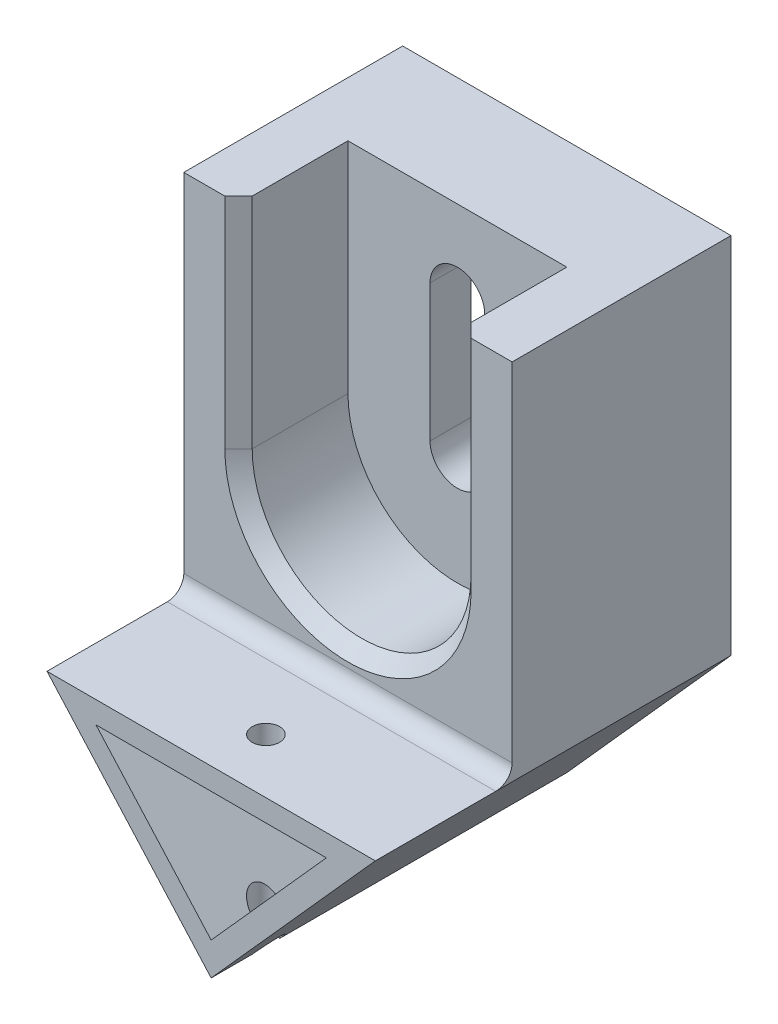
ISO-10303-21;
HEADER;
FILE_DESCRIPTION(('STEP AP214'),'2;1');
FILE_NAME('part.step','',(''),(''),'','','');
FILE_SCHEMA(('AUTOMOTIVE_DESIGN { 1 0 10303 214 1 1 1 1 }'));
ENDSEC;
DATA;
#1=APPLICATION_CONTEXT('core data for automotive mechanical design processes');
#2=APPLICATION_PROTOCOL_DEFINITION('international standard','automotive_design',2000,#1);
#3=PRODUCT_CONTEXT('',#1,'mechanical');
#4=PRODUCT('Part','Part','',(#3));
#5=PRODUCT_RELATED_PRODUCT_CATEGORY('part','',(#4));
#6=PRODUCT_DEFINITION_FORMATION('','',#4);
#7=PRODUCT_DEFINITION_CONTEXT('part definition',#1,'design');
#8=PRODUCT_DEFINITION('design','',#6,#7);
#9=PRODUCT_DEFINITION_SHAPE('','',#8);
#10=(LENGTH_UNIT() NAMED_UNIT(*) SI_UNIT(.MILLI.,.METRE.));
#11=(NAMED_UNIT(*) PLANE_ANGLE_UNIT() SI_UNIT($,.RADIAN.));
#12=(NAMED_UNIT(*) SI_UNIT($,.STERADIAN.) SOLID_ANGLE_UNIT());
#13=UNCERTAINTY_MEASURE_WITH_UNIT(LENGTH_MEASURE(1.E-05),#10,'distance_accuracy_value','');
#14=(GEOMETRIC_REPRESENTATION_CONTEXT(3) GLOBAL_UNCERTAINTY_ASSIGNED_CONTEXT((#13)) GLOBAL_UNIT_ASSIGNED_CONTEXT((#10,
#11,#12)) REPRESENTATION_CONTEXT('',''));
#15=CARTESIAN_POINT('',(0.,0.,0.));
#16=DIRECTION('',(0.,0.,1.));
#17=DIRECTION('',(1.,0.,0.));
#18=AXIS2_PLACEMENT_3D('',#15,#16,#17);
#19=CARTESIAN_POINT('',(0.,0.,130.));
#20=DIRECTION('',(0.,0.,-1.));
#21=DIRECTION('',(-1.,0.,0.));
#22=AXIS2_PLACEMENT_3D('',#19,#20,#21);
#23=PLANE('',#22);
#24=DIRECTION('',(0.666666666666667,0.74535599249993,0.));
#25=VECTOR('',#24,1.);
#26=CARTESIAN_POINT('',(60.,67.0820393249937,130.));
#27=LINE('',#26,#25);
#28=CARTESIAN_POINT('',(0.,0.,130.));
#29=VERTEX_POINT('',#28);
#30=CARTESIAN_POINT('',(60.,67.0820393249937,130.));
#31=VERTEX_POINT('',#30);
#32=EDGE_CURVE('E252',#29,#31,#27,.T.);
#33=ORIENTED_EDGE('',*,*,#32,.T.);
#34=DIRECTION('',(-1.,0.,0.));
#35=VECTOR('',#34,1.);
#36=CARTESIAN_POINT('',(-60.,67.0820393249937,130.));
#37=LINE('',#36,#35);
#38=CARTESIAN_POINT('',(-60.,67.0820393249937,130.));
#39=VERTEX_POINT('',#38);
#40=EDGE_CURVE('E255',#31,#39,#37,.T.);
#41=ORIENTED_EDGE('',*,*,#40,.T.);
#42=DIRECTION('',(0.666666666666667,-0.74535599249993,0.));
#43=VECTOR('',#42,1.);
#44=CARTESIAN_POINT('',(0.,0.,130.));
#45=LINE('',#44,#43);
#46=EDGE_CURVE('E257',#39,#29,#45,.T.);
#47=ORIENTED_EDGE('',*,*,#46,.T.);
#48=EDGE_LOOP('',(#33,#41,#47));
#49=FACE_BOUND('',#48,.T.);
#50=DIRECTION('',(0.666666666666667,0.74535599249993,0.));
#51=VECTOR('',#50,1.);
#52=CARTESIAN_POINT('',(42.1114561800017,59.0820393249937,130.));
#53=LINE('',#52,#51);
#54=CARTESIAN_POINT('',(0.,12.,130.));
#55=VERTEX_POINT('',#54);
#56=CARTESIAN_POINT('',(42.1114561800017,59.0820393249937,130.));
#57=VERTEX_POINT('',#56);
#58=EDGE_CURVE('E242',#55,#57,#53,.T.);
#59=ORIENTED_EDGE('',*,*,#58,.F.);
#60=DIRECTION('',(0.666666666666667,-0.74535599249993,0.));
#61=VECTOR('',#60,1.);
#62=CARTESIAN_POINT('',(0.,12.,130.));
#63=LINE('',#62,#61);
#64=CARTESIAN_POINT('',(-42.1114561800017,59.0820393249937,130.));
#65=VERTEX_POINT('',#64);
#66=EDGE_CURVE('E351',#65,#55,#63,.T.);
#67=ORIENTED_EDGE('',*,*,#66,.F.);
#68=DIRECTION('',(-1.,0.,0.));
#69=VECTOR('',#68,1.);
#70=CARTESIAN_POINT('',(-42.1114561800017,59.0820393249937,130.));
#71=LINE('',#70,#69);
#72=EDGE_CURVE('E348',#57,#65,#71,.T.);
#73=ORIENTED_EDGE('',*,*,#72,.F.);
#74=EDGE_LOOP('',(#59,#67,#73));
#75=FACE_BOUND('',#74,.T.);
#76=ADVANCED_FACE('F42',(#49,#75),#23,.F.);
#77=CARTESIAN_POINT('',(0.,0.,0.));
#78=DIRECTION('',(0.,0.,-1.));
#79=DIRECTION('',(-1.,0.,0.));
#80=AXIS2_PLACEMENT_3D('',#77,#78,#79);
#81=PLANE('',#80);
#82=DIRECTION('',(0.,-1.,0.));
#83=VECTOR('',#82,1.);
#84=CARTESIAN_POINT('',(42.1114561800017,59.0820393249937,0.));
#85=LINE('',#84,#83);
#86=CARTESIAN_POINT('',(42.1114561800017,190.,0.));
#87=VERTEX_POINT('',#86);
#88=CARTESIAN_POINT('',(42.1114561800017,59.0820393249937,0.));
#89=VERTEX_POINT('',#88);
#90=EDGE_CURVE('E215',#87,#89,#85,.T.);
#91=ORIENTED_EDGE('',*,*,#90,.F.);
#92=DIRECTION('',(1.,0.,0.));
#93=VECTOR('',#92,1.);
#94=CARTESIAN_POINT('',(42.1114561800017,190.,0.));
#95=LINE('',#94,#93);
#96=CARTESIAN_POINT('',(-42.1114561800017,190.,0.));
#97=VERTEX_POINT('',#96);
#98=EDGE_CURVE('E225',#97,#87,#95,.T.);
#99=ORIENTED_EDGE('',*,*,#98,.F.);
#100=DIRECTION('',(0.,1.,0.));
#101=VECTOR('',#100,1.);
#102=CARTESIAN_POINT('',(-42.1114561800017,59.0820393249937,0.));
#103=LINE('',#102,#101);
#104=CARTESIAN_POINT('',(-42.1114561800017,59.0820393249937,0.));
#105=VERTEX_POINT('',#104);
#106=EDGE_CURVE('E371',#105,#97,#103,.T.);
#107=ORIENTED_EDGE('',*,*,#106,.F.);
#108=DIRECTION('',(0.666666666666667,-0.74535599249993,0.));
#109=VECTOR('',#108,1.);
#110=CARTESIAN_POINT('',(0.,12.,0.));
#111=LINE('',#110,#109);
#112=CARTESIAN_POINT('',(0.,12.,0.));
#113=VERTEX_POINT('',#112);
#114=EDGE_CURVE('E349',#105,#113,#111,.T.);
#115=ORIENTED_EDGE('',*,*,#114,.T.);
#116=DIRECTION('',(0.666666666666667,0.74535599249993,0.));
#117=VECTOR('',#116,1.);
#118=CARTESIAN_POINT('',(42.1114561800017,59.0820393249937,0.));
#119=LINE('',#118,#117);
#120=EDGE_CURVE('E354',#113,#89,#119,.T.);
#121=ORIENTED_EDGE('',*,*,#120,.T.);
#122=EDGE_LOOP('',(#91,#99,#107,#115,#121));
#123=FACE_BOUND('',#122,.T.);
#124=DIRECTION('',(0.666666666666667,0.74535599249993,0.));
#125=VECTOR('',#124,1.);
#126=CARTESIAN_POINT('',(60.,67.0820393249937,0.));
#127=LINE('',#126,#125);
#128=CARTESIAN_POINT('',(0.,0.,0.));
#129=VERTEX_POINT('',#128);
#130=CARTESIAN_POINT('',(60.,67.0820393249937,0.));
#131=VERTEX_POINT('',#130);
#132=EDGE_CURVE('E243',#129,#131,#127,.T.);
#133=ORIENTED_EDGE('',*,*,#132,.F.);
#134=DIRECTION('',(0.666666666666667,-0.74535599249993,0.));
#135=VECTOR('',#134,1.);
#136=CARTESIAN_POINT('',(0.,0.,0.));
#137=LINE('',#136,#135);
#138=CARTESIAN_POINT('',(-60.,67.0820393249937,0.));
#139=VERTEX_POINT('',#138);
#140=EDGE_CURVE('E246',#139,#129,#137,.T.);
#141=ORIENTED_EDGE('',*,*,#140,.F.);
#142=DIRECTION('',(0.,1.,0.));
#143=VECTOR('',#142,1.);
#144=CARTESIAN_POINT('',(-60.,67.0820393249937,0.));
#145=LINE('',#144,#143);
#146=CARTESIAN_POINT('',(-60.,200.,0.));
#147=VERTEX_POINT('',#146);
#148=EDGE_CURVE('E452',#139,#147,#145,.T.);
#149=ORIENTED_EDGE('',*,*,#148,.T.);
#150=DIRECTION('',(1.,0.,0.));
#151=VECTOR('',#150,1.);
#152=CARTESIAN_POINT('',(60.,200.,0.));
#153=LINE('',#152,#151);
#154=CARTESIAN_POINT('',(60.,200.,0.));
#155=VERTEX_POINT('',#154);
#156=EDGE_CURVE('E449',#147,#155,#153,.T.);
#157=ORIENTED_EDGE('',*,*,#156,.T.);
#158=DIRECTION('',(0.,-1.,0.));
#159=VECTOR('',#158,1.);
#160=CARTESIAN_POINT('',(60.,67.0820393249937,0.));
#161=LINE('',#160,#159);
#162=EDGE_CURVE('E446',#155,#131,#161,.T.);
#163=ORIENTED_EDGE('',*,*,#162,.T.);
#164=EDGE_LOOP('',(#133,#141,#149,#157,#163));
#165=FACE_BOUND('',#164,.T.);
#166=ADVANCED_FACE('F367',(#123,#165),#81,.T.);
#167=CARTESIAN_POINT('',(60.,67.0820393249937,130.));
#168=DIRECTION('',(-0.74535599249993,0.666666666666667,0.));
#169=DIRECTION('',(-0.666666666666667,-0.74535599249993,0.));
#170=AXIS2_PLACEMENT_3D('',#167,#168,#169);
#171=PLANE('',#170);
#172=DIRECTION('',(0.,0.,-1.));
#173=VECTOR('',#172,1.);
#174=CARTESIAN_POINT('',(0.,0.,130.));
#175=LINE('',#174,#173);
#176=CARTESIAN_POINT('',(0.,0.,115.));
#177=VERTEX_POINT('',#176);
#178=EDGE_CURVE('E262',#29,#177,#175,.T.);
#179=ORIENTED_EDGE('',*,*,#178,.T.);
#180=CARTESIAN_POINT('',(0.,0.,110.));
#181=DIRECTION('',(-0.74535599249993,0.666666666666667,0.));
#182=DIRECTION('',(0.666666666666667,0.74535599249993,0.));
#183=AXIS2_PLACEMENT_3D('',#180,#181,#182);
#184=ELLIPSE('',#183,7.50000000000001,5.);
#185=CARTESIAN_POINT('',(0.,0.,105.));
#186=VERTEX_POINT('',#185);
#187=EDGE_CURVE('E443',#177,#186,#184,.T.);
#188=ORIENTED_EDGE('',*,*,#187,.T.);
#189=EDGE_CURVE('E258',#186,#129,#175,.T.);
#190=ORIENTED_EDGE('',*,*,#189,.T.);
#191=ORIENTED_EDGE('',*,*,#132,.T.);
#192=DIRECTION('',(0.,0.,-1.));
#193=VECTOR('',#192,1.);
#194=CARTESIAN_POINT('',(60.,67.0820393249937,80.));
#195=LINE('',#194,#193);
#196=CARTESIAN_POINT('',(60.,67.0820393249937,86.));
#197=VERTEX_POINT('',#196);
#198=EDGE_CURVE('E311',#197,#131,#195,.T.);
#199=ORIENTED_EDGE('',*,*,#198,.F.);
#200=DIRECTION('',(0.,0.,-1.));
#201=VECTOR('',#200,1.);
#202=CARTESIAN_POINT('',(60.,67.0820393249937,130.));
#203=LINE('',#202,#201);
#204=EDGE_CURVE('E268',#31,#197,#203,.T.);
#205=ORIENTED_EDGE('',*,*,#204,.F.);
#206=ORIENTED_EDGE('',*,*,#32,.F.);
#207=EDGE_LOOP('',(#179,#188,#190,#191,#199,#205,#206));
#208=FACE_BOUND('',#207,.T.);
#209=ADVANCED_FACE('F336',(#208),#171,.F.);
#210=CARTESIAN_POINT('',(-60.,67.0820393249937,130.));
#211=DIRECTION('',(0.,-1.,0.));
#212=DIRECTION('',(0.,0.,-1.));
#213=AXIS2_PLACEMENT_3D('',#210,#211,#212);
#214=PLANE('',#213);
#215=CARTESIAN_POINT('',(0.,67.0820393249937,110.));
#216=DIRECTION('',(0.,1.,0.));
#217=DIRECTION('',(0.,0.,1.));
#218=AXIS2_PLACEMENT_3D('',#215,#216,#217);
#219=CIRCLE('',#218,5.);
#220=CARTESIAN_POINT('',(0.,67.0820393249937,115.));
#221=VERTEX_POINT('',#220);
#222=EDGE_CURVE('E425',#221,#221,#219,.T.);
#223=ORIENTED_EDGE('',*,*,#222,.F.);
#224=EDGE_LOOP('',(#223));
#225=FACE_BOUND('',#224,.T.);
#226=ORIENTED_EDGE('',*,*,#204,.T.);
#227=DIRECTION('',(-1.,0.,0.));
#228=VECTOR('',#227,1.);
#229=CARTESIAN_POINT('',(-60.,67.0820393249937,86.));
#230=LINE('',#229,#228);
#231=CARTESIAN_POINT('',(-60.,67.0820393249937,86.));
#232=VERTEX_POINT('',#231);
#233=EDGE_CURVE('E290',#197,#232,#230,.T.);
#234=ORIENTED_EDGE('',*,*,#233,.T.);
#235=DIRECTION('',(0.,0.,-1.));
#236=VECTOR('',#235,1.);
#237=CARTESIAN_POINT('',(-60.,67.0820393249937,130.));
#238=LINE('',#237,#236);
#239=EDGE_CURVE('E265',#39,#232,#238,.T.);
#240=ORIENTED_EDGE('',*,*,#239,.F.);
#241=ORIENTED_EDGE('',*,*,#40,.F.);
#242=EDGE_LOOP('',(#226,#234,#240,#241));
#243=FACE_BOUND('',#242,.T.);
#244=ADVANCED_FACE('F321',(#225,#243),#214,.F.);
#245=CARTESIAN_POINT('',(0.,0.,130.));
#246=DIRECTION('',(0.74535599249993,0.666666666666666,0.));
#247=DIRECTION('',(-0.666666666666667,0.74535599249993,0.));
#248=AXIS2_PLACEMENT_3D('',#245,#246,#247);
#249=PLANE('',#248);
#250=ORIENTED_EDGE('',*,*,#189,.F.);
#251=CARTESIAN_POINT('',(0.,0.,110.));
#252=DIRECTION('',(0.74535599249993,0.666666666666666,0.));
#253=DIRECTION('',(-0.666666666666667,0.74535599249993,0.));
#254=AXIS2_PLACEMENT_3D('',#251,#252,#253);
#255=ELLIPSE('',#254,7.50000000000001,5.);
#256=EDGE_CURVE('E441',#186,#177,#255,.T.);
#257=ORIENTED_EDGE('',*,*,#256,.T.);
#258=ORIENTED_EDGE('',*,*,#178,.F.);
#259=ORIENTED_EDGE('',*,*,#46,.F.);
#260=ORIENTED_EDGE('',*,*,#239,.T.);
#261=DIRECTION('',(0.,0.,-1.));
#262=VECTOR('',#261,1.);
#263=CARTESIAN_POINT('',(-60.,67.0820393249937,80.));
#264=LINE('',#263,#262);
#265=EDGE_CURVE('E328',#232,#139,#264,.T.);
#266=ORIENTED_EDGE('',*,*,#265,.T.);
#267=ORIENTED_EDGE('',*,*,#140,.T.);
#268=EDGE_LOOP('',(#250,#257,#258,#259,#260,#266,#267));
#269=FACE_BOUND('',#268,.T.);
#270=ADVANCED_FACE('F327',(#269),#249,.F.);
#271=CARTESIAN_POINT('',(42.1114561800017,59.0820393249937,130.));
#272=DIRECTION('',(-0.74535599249993,0.666666666666667,0.));
#273=DIRECTION('',(-0.666666666666667,-0.74535599249993,0.));
#274=AXIS2_PLACEMENT_3D('',#271,#272,#273);
#275=PLANE('',#274);
#276=CARTESIAN_POINT('',(0.,12.,110.));
#277=DIRECTION('',(-0.74535599249993,0.666666666666667,0.));
#278=DIRECTION('',(0.666666666666667,0.74535599249993,0.));
#279=AXIS2_PLACEMENT_3D('',#276,#277,#278);
#280=ELLIPSE('',#279,7.50000000000001,5.);
#281=CARTESIAN_POINT('',(0.,12.,115.));
#282=VERTEX_POINT('',#281);
#283=CARTESIAN_POINT('',(0.,12.,105.));
#284=VERTEX_POINT('',#283);
#285=EDGE_CURVE('E436',#282,#284,#280,.T.);
#286=ORIENTED_EDGE('',*,*,#285,.F.);
#287=DIRECTION('',(0.,0.,-1.));
#288=VECTOR('',#287,1.);
#289=CARTESIAN_POINT('',(0.,12.,130.));
#290=LINE('',#289,#288);
#291=EDGE_CURVE('E248',#55,#282,#290,.T.);
#292=ORIENTED_EDGE('',*,*,#291,.F.);
#293=ORIENTED_EDGE('',*,*,#58,.T.);
#294=DIRECTION('',(0.,0.,-1.));
#295=VECTOR('',#294,1.);
#296=CARTESIAN_POINT('',(42.1114561800017,59.0820393249937,130.));
#297=LINE('',#296,#295);
#298=CARTESIAN_POINT('',(42.1114561800017,59.0820393249937,25.));
#299=VERTEX_POINT('',#298);
#300=EDGE_CURVE('E233',#57,#299,#297,.T.);
#301=ORIENTED_EDGE('',*,*,#300,.T.);
#302=DIRECTION('',(0.,0.,-1.));
#303=VECTOR('',#302,1.);
#304=CARTESIAN_POINT('',(42.1114561800017,59.0820393249937,25.));
#305=LINE('',#304,#303);
#306=EDGE_CURVE('E210',#299,#89,#305,.T.);
#307=ORIENTED_EDGE('',*,*,#306,.T.);
#308=ORIENTED_EDGE('',*,*,#120,.F.);
#309=EDGE_CURVE('E353',#284,#113,#290,.T.);
#310=ORIENTED_EDGE('',*,*,#309,.F.);
#311=EDGE_LOOP('',(#286,#292,#293,#301,#307,#308,#310));
#312=FACE_BOUND('',#311,.T.);
#313=ADVANCED_FACE('F239',(#312),#275,.T.);
#314=CARTESIAN_POINT('',(-42.1114561800017,59.0820393249937,130.));
#315=DIRECTION('',(0.,-1.,0.));
#316=DIRECTION('',(0.,0.,-1.));
#317=AXIS2_PLACEMENT_3D('',#314,#315,#316);
#318=PLANE('',#317);
#319=DIRECTION('',(-1.,0.,0.));
#320=VECTOR('',#319,1.);
#321=CARTESIAN_POINT('',(42.1114561800017,59.0820393249937,25.));
#322=LINE('',#321,#320);
#323=CARTESIAN_POINT('',(-42.1114561800017,59.0820393249937,25.));
#324=VERTEX_POINT('',#323);
#325=EDGE_CURVE('E57',#299,#324,#322,.T.);
#326=ORIENTED_EDGE('',*,*,#325,.F.);
#327=ORIENTED_EDGE('',*,*,#300,.F.);
#328=ORIENTED_EDGE('',*,*,#72,.T.);
#329=DIRECTION('',(0.,0.,-1.));
#330=VECTOR('',#329,1.);
#331=CARTESIAN_POINT('',(-42.1114561800017,59.0820393249937,130.));
#332=LINE('',#331,#330);
#333=EDGE_CURVE('E235',#65,#324,#332,.T.);
#334=ORIENTED_EDGE('',*,*,#333,.T.);
#335=EDGE_LOOP('',(#326,#327,#328,#334));
#336=FACE_BOUND('',#335,.T.);
#337=CARTESIAN_POINT('',(0.,59.0820393249937,110.));
#338=DIRECTION('',(0.,-1.,0.));
#339=DIRECTION('',(0.,0.,-1.));
#340=AXIS2_PLACEMENT_3D('',#337,#338,#339);
#341=CIRCLE('',#340,5.);
#342=CARTESIAN_POINT('',(0.,59.0820393249937,105.));
#343=VERTEX_POINT('',#342);
#344=EDGE_CURVE('E438',#343,#343,#341,.T.);
#345=ORIENTED_EDGE('',*,*,#344,.F.);
#346=EDGE_LOOP('',(#345));
#347=FACE_BOUND('',#346,.T.);
#348=ADVANCED_FACE('F230',(#336,#347),#318,.T.);
#349=CARTESIAN_POINT('',(0.,12.,130.));
#350=DIRECTION('',(0.74535599249993,0.666666666666667,0.));
#351=DIRECTION('',(-0.666666666666667,0.74535599249993,0.));
#352=AXIS2_PLACEMENT_3D('',#349,#350,#351);
#353=PLANE('',#352);
#354=CARTESIAN_POINT('',(0.,12.,110.));
#355=DIRECTION('',(0.74535599249993,0.666666666666667,0.));
#356=DIRECTION('',(-0.666666666666667,0.74535599249993,0.));
#357=AXIS2_PLACEMENT_3D('',#354,#355,#356);
#358=ELLIPSE('',#357,7.50000000000001,5.);
#359=EDGE_CURVE('E271',#284,#282,#358,.T.);
#360=ORIENTED_EDGE('',*,*,#359,.F.);
#361=ORIENTED_EDGE('',*,*,#309,.T.);
#362=ORIENTED_EDGE('',*,*,#114,.F.);
#363=DIRECTION('',(0.,0.,-1.));
#364=VECTOR('',#363,1.);
#365=CARTESIAN_POINT('',(-42.1114561800017,59.0820393249937,25.));
#366=LINE('',#365,#364);
#367=EDGE_CURVE('E220',#324,#105,#366,.T.);
#368=ORIENTED_EDGE('',*,*,#367,.F.);
#369=ORIENTED_EDGE('',*,*,#333,.F.);
#370=ORIENTED_EDGE('',*,*,#66,.T.);
#371=ORIENTED_EDGE('',*,*,#291,.T.);
#372=EDGE_LOOP('',(#360,#361,#362,#368,#369,#370,#371));
#373=FACE_BOUND('',#372,.T.);
#374=ADVANCED_FACE('F363',(#373),#353,.T.);
#375=CARTESIAN_POINT('',(60.,67.0820393249937,80.));
#376=DIRECTION('',(1.,0.,0.));
#377=DIRECTION('',(0.,0.,-1.));
#378=AXIS2_PLACEMENT_3D('',#375,#376,#377);
#379=PLANE('',#378);
#380=ORIENTED_EDGE('',*,*,#162,.F.);
#381=DIRECTION('',(0.,0.,-1.));
#382=VECTOR('',#381,1.);
#383=CARTESIAN_POINT('',(60.,200.,80.));
#384=LINE('',#383,#382);
#385=CARTESIAN_POINT('',(60.,200.,80.));
#386=VERTEX_POINT('',#385);
#387=EDGE_CURVE('E356',#386,#155,#384,.T.);
#388=ORIENTED_EDGE('',*,*,#387,.F.);
#389=DIRECTION('',(0.,-1.,0.));
#390=VECTOR('',#389,1.);
#391=CARTESIAN_POINT('',(60.,67.0820393249937,80.));
#392=LINE('',#391,#390);
#393=CARTESIAN_POINT('',(60.,73.0820393249937,80.));
#394=VERTEX_POINT('',#393);
#395=EDGE_CURVE('E315',#386,#394,#392,.T.);
#396=ORIENTED_EDGE('',*,*,#395,.T.);
#397=CARTESIAN_POINT('',(60.,73.0820393249937,86.));
#398=DIRECTION('',(1.,0.,0.));
#399=DIRECTION('',(0.,0.,-1.));
#400=AXIS2_PLACEMENT_3D('',#397,#398,#399);
#401=CIRCLE('',#400,6.);
#402=EDGE_CURVE('E50',#394,#197,#401,.F.);
#403=ORIENTED_EDGE('',*,*,#402,.T.);
#404=ORIENTED_EDGE('',*,*,#198,.T.);
#405=EDGE_LOOP('',(#380,#388,#396,#403,#404));
#406=FACE_BOUND('',#405,.T.);
#407=ADVANCED_FACE('F310',(#406),#379,.T.);
#408=CARTESIAN_POINT('',(60.,200.,80.));
#409=DIRECTION('',(0.,1.,0.));
#410=DIRECTION('',(0.,0.,1.));
#411=AXIS2_PLACEMENT_3D('',#408,#409,#410);
#412=PLANE('',#411);
#413=DIRECTION('',(0.,0.,1.));
#414=VECTOR('',#413,1.);
#415=CARTESIAN_POINT('',(40.,200.,40.));
#416=LINE('',#415,#414);
#417=CARTESIAN_POINT('',(40.,200.,40.));
#418=VERTEX_POINT('',#417);
#419=CARTESIAN_POINT('',(40.,200.,74.9999999999999));
#420=VERTEX_POINT('',#419);
#421=EDGE_CURVE('E422',#418,#420,#416,.T.);
#422=ORIENTED_EDGE('',*,*,#421,.T.);
#423=DIRECTION('',(0.70710678118655,0.,0.707106781186546));
#424=VECTOR('',#423,1.);
#425=CARTESIAN_POINT('',(52.5000000000001,200.,87.5));
#426=LINE('',#425,#424);
#427=CARTESIAN_POINT('',(45.0000000000001,200.,80.));
#428=VERTEX_POINT('',#427);
#429=EDGE_CURVE('E278',#420,#428,#426,.T.);
#430=ORIENTED_EDGE('',*,*,#429,.T.);
#431=DIRECTION('',(1.,0.,0.));
#432=VECTOR('',#431,1.);
#433=CARTESIAN_POINT('',(60.,200.,80.));
#434=LINE('',#433,#432);
#435=EDGE_CURVE('E343',#428,#386,#434,.T.);
#436=ORIENTED_EDGE('',*,*,#435,.T.);
#437=ORIENTED_EDGE('',*,*,#387,.T.);
#438=ORIENTED_EDGE('',*,*,#156,.F.);
#439=DIRECTION('',(0.,0.,-1.));
#440=VECTOR('',#439,1.);
#441=CARTESIAN_POINT('',(-60.,200.,80.));
#442=LINE('',#441,#440);
#443=CARTESIAN_POINT('',(-60.,200.,80.));
#444=VERTEX_POINT('',#443);
#445=EDGE_CURVE('E340',#444,#147,#442,.T.);
#446=ORIENTED_EDGE('',*,*,#445,.F.);
#447=CARTESIAN_POINT('',(-45.0000000000001,200.,80.));
#448=VERTEX_POINT('',#447);
#449=EDGE_CURVE('E338',#444,#448,#434,.T.);
#450=ORIENTED_EDGE('',*,*,#449,.T.);
#451=DIRECTION('',(0.70710678118655,0.,-0.707106781186546));
#452=VECTOR('',#451,1.);
#453=CARTESIAN_POINT('',(7.50000000000027,200.,27.4999999999999));
#454=LINE('',#453,#452);
#455=CARTESIAN_POINT('',(-40.,200.,74.9999999999999));
#456=VERTEX_POINT('',#455);
#457=EDGE_CURVE('E276',#448,#456,#454,.T.);
#458=ORIENTED_EDGE('',*,*,#457,.T.);
#459=DIRECTION('',(0.,0.,1.));
#460=VECTOR('',#459,1.);
#461=CARTESIAN_POINT('',(-40.,200.,40.));
#462=LINE('',#461,#460);
#463=CARTESIAN_POINT('',(-40.,200.,40.));
#464=VERTEX_POINT('',#463);
#465=EDGE_CURVE('E421',#464,#456,#462,.T.);
#466=ORIENTED_EDGE('',*,*,#465,.F.);
#467=DIRECTION('',(-1.,0.,0.));
#468=VECTOR('',#467,1.);
#469=CARTESIAN_POINT('',(-40.,200.,40.));
#470=LINE('',#469,#468);
#471=EDGE_CURVE('E298',#418,#464,#470,.T.);
#472=ORIENTED_EDGE('',*,*,#471,.F.);
#473=EDGE_LOOP('',(#422,#430,#436,#437,#438,#446,#450,#458,#466,#472));
#474=FACE_BOUND('',#473,.T.);
#475=ADVANCED_FACE('F464',(#474),#412,.T.);
#476=CARTESIAN_POINT('',(-60.,67.0820393249937,80.));
#477=DIRECTION('',(-1.,0.,0.));
#478=DIRECTION('',(0.,0.,1.));
#479=AXIS2_PLACEMENT_3D('',#476,#477,#478);
#480=PLANE('',#479);
#481=ORIENTED_EDGE('',*,*,#148,.F.);
#482=ORIENTED_EDGE('',*,*,#265,.F.);
#483=CARTESIAN_POINT('',(-60.,73.0820393249937,86.));
#484=DIRECTION('',(-1.,0.,0.));
#485=DIRECTION('',(0.,0.,1.));
#486=AXIS2_PLACEMENT_3D('',#483,#484,#485);
#487=CIRCLE('',#486,6.);
#488=CARTESIAN_POINT('',(-60.,73.0820393249937,80.));
#489=VERTEX_POINT('',#488);
#490=EDGE_CURVE('E303',#232,#489,#487,.F.);
#491=ORIENTED_EDGE('',*,*,#490,.T.);
#492=DIRECTION('',(0.,1.,0.));
#493=VECTOR('',#492,1.);
#494=CARTESIAN_POINT('',(-60.,67.0820393249937,80.));
#495=LINE('',#494,#493);
#496=EDGE_CURVE('E448',#489,#444,#495,.T.);
#497=ORIENTED_EDGE('',*,*,#496,.T.);
#498=ORIENTED_EDGE('',*,*,#445,.T.);
#499=EDGE_LOOP('',(#481,#482,#491,#497,#498));
#500=FACE_BOUND('',#499,.T.);
#501=ADVANCED_FACE('F459',(#500),#480,.T.);
#502=CARTESIAN_POINT('',(0.,0.,80.));
#503=DIRECTION('',(0.,0.,1.));
#504=DIRECTION('',(1.,0.,0.));
#505=AXIS2_PLACEMENT_3D('',#502,#503,#504);
#506=PLANE('',#505);
#507=ORIENTED_EDGE('',*,*,#496,.F.);
#508=DIRECTION('',(-1.,0.,0.));
#509=VECTOR('',#508,1.);
#510=CARTESIAN_POINT('',(0.,73.0820393249937,80.));
#511=LINE('',#510,#509);
#512=EDGE_CURVE('E301',#489,#394,#511,.F.);
#513=ORIENTED_EDGE('',*,*,#512,.T.);
#514=ORIENTED_EDGE('',*,*,#395,.F.);
#515=ORIENTED_EDGE('',*,*,#435,.F.);
#516=DIRECTION('',(0.,-1.,0.));
#517=VECTOR('',#516,1.);
#518=CARTESIAN_POINT('',(45.0000000000001,120.,80.));
#519=LINE('',#518,#517);
#520=CARTESIAN_POINT('',(45.0000000000001,120.,80.));
#521=VERTEX_POINT('',#520);
#522=EDGE_CURVE('E284',#428,#521,#519,.T.);
#523=ORIENTED_EDGE('',*,*,#522,.T.);
#524=CARTESIAN_POINT('',(0.,120.,80.));
#525=DIRECTION('',(0.,0.,1.));
#526=DIRECTION('',(1.,0.,0.));
#527=AXIS2_PLACEMENT_3D('',#524,#525,#526);
#528=CIRCLE('',#527,45.0000000000001);
#529=CARTESIAN_POINT('',(-45.0000000000001,120.,80.));
#530=VERTEX_POINT('',#529);
#531=EDGE_CURVE('E282',#521,#530,#528,.F.);
#532=ORIENTED_EDGE('',*,*,#531,.T.);
#533=DIRECTION('',(0.,1.,0.));
#534=VECTOR('',#533,1.);
#535=CARTESIAN_POINT('',(-45.0000000000001,200.,80.));
#536=LINE('',#535,#534);
#537=EDGE_CURVE('E280',#530,#448,#536,.T.);
#538=ORIENTED_EDGE('',*,*,#537,.T.);
#539=ORIENTED_EDGE('',*,*,#449,.F.);
#540=EDGE_LOOP('',(#507,#513,#514,#515,#523,#532,#538,#539));
#541=FACE_BOUND('',#540,.T.);
#542=ADVANCED_FACE('F467',(#541),#506,.T.);
#543=CARTESIAN_POINT('',(0.,0.,110.));
#544=DIRECTION('',(0.,1.,0.));
#545=DIRECTION('',(0.,0.,1.));
#546=AXIS2_PLACEMENT_3D('',#543,#544,#545);
#547=CYLINDRICAL_SURFACE('',#546,5.);
#548=ORIENTED_EDGE('',*,*,#285,.T.);
#549=ORIENTED_EDGE('',*,*,#359,.T.);
#550=EDGE_LOOP('',(#548,#549));
#551=FACE_BOUND('',#550,.T.);
#552=ORIENTED_EDGE('',*,*,#256,.F.);
#553=ORIENTED_EDGE('',*,*,#187,.F.);
#554=EDGE_LOOP('',(#552,#553));
#555=FACE_BOUND('',#554,.T.);
#556=ADVANCED_FACE('F578',(#551,#555),#547,.F.);
#557=ORIENTED_EDGE('',*,*,#344,.T.);
#558=EDGE_LOOP('',(#557));
#559=FACE_BOUND('',#558,.T.);
#560=ORIENTED_EDGE('',*,*,#222,.T.);
#561=EDGE_LOOP('',(#560));
#562=FACE_BOUND('',#561,.T.);
#563=ADVANCED_FACE('F585',(#559,#562),#547,.F.);
#564=CARTESIAN_POINT('',(40.,200.,40.));
#565=DIRECTION('',(1.,0.,0.));
#566=DIRECTION('',(0.,1.,0.));
#567=AXIS2_PLACEMENT_3D('',#564,#565,#566);
#568=PLANE('',#567);
#569=DIRECTION('',(0.,0.,1.));
#570=VECTOR('',#569,1.);
#571=CARTESIAN_POINT('',(40.,120.,40.));
#572=LINE('',#571,#570);
#573=CARTESIAN_POINT('',(40.,120.,40.));
#574=VERTEX_POINT('',#573);
#575=CARTESIAN_POINT('',(40.,120.,74.9999999999999));
#576=VERTEX_POINT('',#575);
#577=EDGE_CURVE('E426',#574,#576,#572,.T.);
#578=ORIENTED_EDGE('',*,*,#577,.T.);
#579=DIRECTION('',(0.,1.,0.));
#580=VECTOR('',#579,1.);
#581=CARTESIAN_POINT('',(40.,200.,74.9999999999999));
#582=LINE('',#581,#580);
#583=EDGE_CURVE('E273',#576,#420,#582,.T.);
#584=ORIENTED_EDGE('',*,*,#583,.T.);
#585=ORIENTED_EDGE('',*,*,#421,.F.);
#586=DIRECTION('',(0.,1.,0.));
#587=VECTOR('',#586,1.);
#588=CARTESIAN_POINT('',(40.,200.,40.));
#589=LINE('',#588,#587);
#590=EDGE_CURVE('E418',#574,#418,#589,.T.);
#591=ORIENTED_EDGE('',*,*,#590,.F.);
#592=EDGE_LOOP('',(#578,#584,#585,#591));
#593=FACE_BOUND('',#592,.T.);
#594=ADVANCED_FACE('F487',(#593),#568,.F.);
#595=CARTESIAN_POINT('',(0.,120.,40.));
#596=DIRECTION('',(0.,0.,1.));
#597=DIRECTION('',(1.,0.,0.));
#598=AXIS2_PLACEMENT_3D('',#595,#596,#597);
#599=CYLINDRICAL_SURFACE('',#598,40.);
#600=DIRECTION('',(0.,0.,1.));
#601=VECTOR('',#600,1.);
#602=CARTESIAN_POINT('',(-40.,120.,40.));
#603=LINE('',#602,#601);
#604=CARTESIAN_POINT('',(-40.,120.,40.));
#605=VERTEX_POINT('',#604);
#606=CARTESIAN_POINT('',(-40.,120.,74.9999999999999));
#607=VERTEX_POINT('',#606);
#608=EDGE_CURVE('E429',#605,#607,#603,.T.);
#609=ORIENTED_EDGE('',*,*,#608,.T.);
#610=CARTESIAN_POINT('',(0.,120.,74.9999999999999));
#611=DIRECTION('',(0.,0.,1.));
#612=DIRECTION('',(1.,0.,0.));
#613=AXIS2_PLACEMENT_3D('',#610,#611,#612);
#614=CIRCLE('',#613,40.);
#615=EDGE_CURVE('E286',#607,#576,#614,.T.);
#616=ORIENTED_EDGE('',*,*,#615,.T.);
#617=ORIENTED_EDGE('',*,*,#577,.F.);
#618=CARTESIAN_POINT('',(0.,120.,40.));
#619=DIRECTION('',(0.,0.,1.));
#620=DIRECTION('',(1.,0.,0.));
#621=AXIS2_PLACEMENT_3D('',#618,#619,#620);
#622=CIRCLE('',#621,40.);
#623=EDGE_CURVE('E415',#605,#574,#622,.T.);
#624=ORIENTED_EDGE('',*,*,#623,.F.);
#625=EDGE_LOOP('',(#609,#616,#617,#624));
#626=FACE_BOUND('',#625,.T.);
#627=ADVANCED_FACE('F481',(#626),#599,.F.);
#628=CARTESIAN_POINT('',(-40.,200.,40.));
#629=DIRECTION('',(-1.,0.,0.));
#630=DIRECTION('',(0.,0.,1.));
#631=AXIS2_PLACEMENT_3D('',#628,#629,#630);
#632=PLANE('',#631);
#633=ORIENTED_EDGE('',*,*,#465,.T.);
#634=DIRECTION('',(0.,-1.,0.));
#635=VECTOR('',#634,1.);
#636=CARTESIAN_POINT('',(-40.,120.,74.9999999999999));
#637=LINE('',#636,#635);
#638=EDGE_CURVE('E288',#456,#607,#637,.T.);
#639=ORIENTED_EDGE('',*,*,#638,.T.);
#640=ORIENTED_EDGE('',*,*,#608,.F.);
#641=DIRECTION('',(0.,-1.,0.));
#642=VECTOR('',#641,1.);
#643=CARTESIAN_POINT('',(-40.,200.,40.));
#644=LINE('',#643,#642);
#645=EDGE_CURVE('E412',#464,#605,#644,.T.);
#646=ORIENTED_EDGE('',*,*,#645,.F.);
#647=EDGE_LOOP('',(#633,#639,#640,#646));
#648=FACE_BOUND('',#647,.T.);
#649=ADVANCED_FACE('F478',(#648),#632,.F.);
#650=CARTESIAN_POINT('',(0.,120.,40.));
#651=DIRECTION('',(0.,0.,1.));
#652=DIRECTION('',(1.,0.,0.));
#653=AXIS2_PLACEMENT_3D('',#650,#651,#652);
#654=PLANE('',#653);
#655=CARTESIAN_POINT('',(0.,170.,40.));
#656=DIRECTION('',(0.,0.,1.));
#657=DIRECTION('',(1.,0.,0.));
#658=AXIS2_PLACEMENT_3D('',#655,#656,#657);
#659=CIRCLE('',#658,10.);
#660=CARTESIAN_POINT('',(10.,170.,40.));
#661=VERTEX_POINT('',#660);
#662=CARTESIAN_POINT('',(-9.99999999999999,170.,40.));
#663=VERTEX_POINT('',#662);
#664=EDGE_CURVE('E391',#661,#663,#659,.T.);
#665=ORIENTED_EDGE('',*,*,#664,.F.);
#666=DIRECTION('',(0.,1.,0.));
#667=VECTOR('',#666,1.);
#668=CARTESIAN_POINT('',(10.,170.,40.));
#669=LINE('',#668,#667);
#670=CARTESIAN_POINT('',(10.,120.,40.));
#671=VERTEX_POINT('',#670);
#672=EDGE_CURVE('E400',#671,#661,#669,.T.);
#673=ORIENTED_EDGE('',*,*,#672,.F.);
#674=CARTESIAN_POINT('',(0.,120.,40.));
#675=DIRECTION('',(0.,0.,1.));
#676=DIRECTION('',(1.,0.,0.));
#677=AXIS2_PLACEMENT_3D('',#674,#675,#676);
#678=CIRCLE('',#677,10.);
#679=CARTESIAN_POINT('',(-9.99999999999999,120.,40.));
#680=VERTEX_POINT('',#679);
#681=EDGE_CURVE('E397',#680,#671,#678,.T.);
#682=ORIENTED_EDGE('',*,*,#681,.F.);
#683=DIRECTION('',(0.,-1.,0.));
#684=VECTOR('',#683,1.);
#685=CARTESIAN_POINT('',(-9.99999999999999,170.,40.));
#686=LINE('',#685,#684);
#687=EDGE_CURVE('E394',#663,#680,#686,.T.);
#688=ORIENTED_EDGE('',*,*,#687,.F.);
#689=EDGE_LOOP('',(#665,#673,#682,#688));
#690=FACE_BOUND('',#689,.T.);
#691=ORIENTED_EDGE('',*,*,#471,.T.);
#692=ORIENTED_EDGE('',*,*,#645,.T.);
#693=ORIENTED_EDGE('',*,*,#623,.T.);
#694=ORIENTED_EDGE('',*,*,#590,.T.);
#695=EDGE_LOOP('',(#691,#692,#693,#694));
#696=FACE_BOUND('',#695,.T.);
#697=ADVANCED_FACE('F484',(#690,#696),#654,.T.);
#698=CARTESIAN_POINT('',(-40.,200.,74.9999999999999));
#699=DIRECTION('',(0.707106781186545,0.,0.707106781186549));
#700=DIRECTION('',(0.,1.,0.));
#701=AXIS2_PLACEMENT_3D('',#698,#699,#700);
#702=PLANE('',#701);
#703=ORIENTED_EDGE('',*,*,#457,.F.);
#704=ORIENTED_EDGE('',*,*,#537,.F.);
#705=DIRECTION('',(-0.707106781186549,0.,0.707106781186545));
#706=VECTOR('',#705,1.);
#707=CARTESIAN_POINT('',(-40.,120.,74.9999999999999));
#708=LINE('',#707,#706);
#709=EDGE_CURVE('E294',#607,#530,#708,.T.);
#710=ORIENTED_EDGE('',*,*,#709,.F.);
#711=ORIENTED_EDGE('',*,*,#638,.F.);
#712=EDGE_LOOP('',(#703,#704,#710,#711));
#713=FACE_BOUND('',#712,.T.);
#714=ADVANCED_FACE('F474',(#713),#702,.T.);
#715=CARTESIAN_POINT('',(0.,120.,74.9999999999999));
#716=DIRECTION('',(0.,0.,1.));
#717=DIRECTION('',(1.,0.,0.));
#718=AXIS2_PLACEMENT_3D('',#715,#716,#717);
#719=CONICAL_SURFACE('',#718,40.,0.785398163397451);
#720=ORIENTED_EDGE('',*,*,#709,.T.);
#721=ORIENTED_EDGE('',*,*,#531,.F.);
#722=DIRECTION('',(0.707106781186549,0.,0.707106781186545));
#723=VECTOR('',#722,1.);
#724=CARTESIAN_POINT('',(40.,120.,74.9999999999999));
#725=LINE('',#724,#723);
#726=EDGE_CURVE('E291',#576,#521,#725,.T.);
#727=ORIENTED_EDGE('',*,*,#726,.F.);
#728=ORIENTED_EDGE('',*,*,#615,.F.);
#729=EDGE_LOOP('',(#720,#721,#727,#728));
#730=FACE_BOUND('',#729,.T.);
#731=ADVANCED_FACE('F494',(#730),#719,.F.);
#732=CARTESIAN_POINT('',(40.,200.,74.9999999999999));
#733=DIRECTION('',(-0.707106781186545,0.,0.707106781186549));
#734=DIRECTION('',(0.,-1.,0.));
#735=AXIS2_PLACEMENT_3D('',#732,#733,#734);
#736=PLANE('',#735);
#737=ORIENTED_EDGE('',*,*,#726,.T.);
#738=ORIENTED_EDGE('',*,*,#522,.F.);
#739=ORIENTED_EDGE('',*,*,#429,.F.);
#740=ORIENTED_EDGE('',*,*,#583,.F.);
#741=EDGE_LOOP('',(#737,#738,#739,#740));
#742=FACE_BOUND('',#741,.T.);
#743=ADVANCED_FACE('F491',(#742),#736,.T.);
#744=CARTESIAN_POINT('',(-60.,73.0820393249937,86.));
#745=DIRECTION('',(-1.,0.,0.));
#746=DIRECTION('',(0.,0.,1.));
#747=AXIS2_PLACEMENT_3D('',#744,#745,#746);
#748=CYLINDRICAL_SURFACE('',#747,6.);
#749=ORIENTED_EDGE('',*,*,#402,.F.);
#750=ORIENTED_EDGE('',*,*,#512,.F.);
#751=ORIENTED_EDGE('',*,*,#490,.F.);
#752=ORIENTED_EDGE('',*,*,#233,.F.);
#753=EDGE_LOOP('',(#749,#750,#751,#752));
#754=FACE_BOUND('',#753,.T.);
#755=ADVANCED_FACE('F44',(#754),#748,.F.);
#756=CARTESIAN_POINT('',(0.,170.,0.));
#757=DIRECTION('',(0.,0.,1.));
#758=DIRECTION('',(1.,0.,0.));
#759=AXIS2_PLACEMENT_3D('',#756,#757,#758);
#760=CYLINDRICAL_SURFACE('',#759,10.);
#761=DIRECTION('',(0.,0.,1.));
#762=VECTOR('',#761,1.);
#763=CARTESIAN_POINT('',(-9.99999999999999,170.,0.));
#764=LINE('',#763,#762);
#765=CARTESIAN_POINT('',(-9.99999999999999,170.,25.));
#766=VERTEX_POINT('',#765);
#767=EDGE_CURVE('E403',#766,#663,#764,.T.);
#768=ORIENTED_EDGE('',*,*,#767,.F.);
#769=CARTESIAN_POINT('',(0.,170.,25.));
#770=DIRECTION('',(0.,0.,1.));
#771=DIRECTION('',(1.,0.,0.));
#772=AXIS2_PLACEMENT_3D('',#769,#770,#771);
#773=CIRCLE('',#772,10.);
#774=CARTESIAN_POINT('',(10.,170.,25.));
#775=VERTEX_POINT('',#774);
#776=EDGE_CURVE('E65',#766,#775,#773,.F.);
#777=ORIENTED_EDGE('',*,*,#776,.T.);
#778=DIRECTION('',(0.,0.,1.));
#779=VECTOR('',#778,1.);
#780=CARTESIAN_POINT('',(10.,170.,0.));
#781=LINE('',#780,#779);
#782=EDGE_CURVE('E295',#775,#661,#781,.T.);
#783=ORIENTED_EDGE('',*,*,#782,.T.);
#784=ORIENTED_EDGE('',*,*,#664,.T.);
#785=EDGE_LOOP('',(#768,#777,#783,#784));
#786=FACE_BOUND('',#785,.T.);
#787=ADVANCED_FACE('F641',(#786),#760,.F.);
#788=CARTESIAN_POINT('',(10.,170.,0.));
#789=DIRECTION('',(1.,0.,0.));
#790=DIRECTION('',(0.,1.,0.));
#791=AXIS2_PLACEMENT_3D('',#788,#789,#790);
#792=PLANE('',#791);
#793=ORIENTED_EDGE('',*,*,#782,.F.);
#794=DIRECTION('',(0.,-1.,0.));
#795=VECTOR('',#794,1.);
#796=CARTESIAN_POINT('',(10.,170.,25.));
#797=LINE('',#796,#795);
#798=CARTESIAN_POINT('',(10.,120.,25.));
#799=VERTEX_POINT('',#798);
#800=EDGE_CURVE('E387',#775,#799,#797,.T.);
#801=ORIENTED_EDGE('',*,*,#800,.T.);
#802=DIRECTION('',(0.,0.,1.));
#803=VECTOR('',#802,1.);
#804=CARTESIAN_POINT('',(10.,120.,0.));
#805=LINE('',#804,#803);
#806=EDGE_CURVE('E405',#799,#671,#805,.T.);
#807=ORIENTED_EDGE('',*,*,#806,.T.);
#808=ORIENTED_EDGE('',*,*,#672,.T.);
#809=EDGE_LOOP('',(#793,#801,#807,#808));
#810=FACE_BOUND('',#809,.T.);
#811=ADVANCED_FACE('F649',(#810),#792,.F.);
#812=CARTESIAN_POINT('',(0.,120.,0.));
#813=DIRECTION('',(0.,0.,1.));
#814=DIRECTION('',(1.,0.,0.));
#815=AXIS2_PLACEMENT_3D('',#812,#813,#814);
#816=CYLINDRICAL_SURFACE('',#815,10.);
#817=ORIENTED_EDGE('',*,*,#806,.F.);
#818=CARTESIAN_POINT('',(0.,120.,25.));
#819=DIRECTION('',(0.,0.,1.));
#820=DIRECTION('',(1.,0.,0.));
#821=AXIS2_PLACEMENT_3D('',#818,#819,#820);
#822=CIRCLE('',#821,10.);
#823=CARTESIAN_POINT('',(-9.99999999999998,120.,25.));
#824=VERTEX_POINT('',#823);
#825=EDGE_CURVE('E381',#799,#824,#822,.F.);
#826=ORIENTED_EDGE('',*,*,#825,.T.);
#827=DIRECTION('',(0.,0.,1.));
#828=VECTOR('',#827,1.);
#829=CARTESIAN_POINT('',(-9.99999999999999,120.,0.));
#830=LINE('',#829,#828);
#831=EDGE_CURVE('E407',#824,#680,#830,.T.);
#832=ORIENTED_EDGE('',*,*,#831,.T.);
#833=ORIENTED_EDGE('',*,*,#681,.T.);
#834=EDGE_LOOP('',(#817,#826,#832,#833));
#835=FACE_BOUND('',#834,.T.);
#836=ADVANCED_FACE('F659',(#835),#816,.F.);
#837=CARTESIAN_POINT('',(-9.99999999999999,170.,0.));
#838=DIRECTION('',(-1.,0.,0.));
#839=DIRECTION('',(0.,-1.,0.));
#840=AXIS2_PLACEMENT_3D('',#837,#838,#839);
#841=PLANE('',#840);
#842=ORIENTED_EDGE('',*,*,#831,.F.);
#843=DIRECTION('',(0.,1.,0.));
#844=VECTOR('',#843,1.);
#845=CARTESIAN_POINT('',(-9.99999999999999,170.,25.));
#846=LINE('',#845,#844);
#847=EDGE_CURVE('E11',#824,#766,#846,.T.);
#848=ORIENTED_EDGE('',*,*,#847,.T.);
#849=ORIENTED_EDGE('',*,*,#767,.T.);
#850=ORIENTED_EDGE('',*,*,#687,.T.);
#851=EDGE_LOOP('',(#842,#848,#849,#850));
#852=FACE_BOUND('',#851,.T.);
#853=ADVANCED_FACE('F669',(#852),#841,.F.);
#854=CARTESIAN_POINT('',(0.,0.,25.));
#855=DIRECTION('',(0.,0.,1.));
#856=DIRECTION('',(1.,0.,0.));
#857=AXIS2_PLACEMENT_3D('',#854,#855,#856);
#858=PLANE('',#857);
#859=DIRECTION('',(0.,-1.,0.));
#860=VECTOR('',#859,1.);
#861=CARTESIAN_POINT('',(42.1114561800017,59.0820393249937,25.));
#862=LINE('',#861,#860);
#863=CARTESIAN_POINT('',(42.1114561800017,190.,25.));
#864=VERTEX_POINT('',#863);
#865=EDGE_CURVE('E212',#864,#299,#862,.T.);
#866=ORIENTED_EDGE('',*,*,#865,.T.);
#867=ORIENTED_EDGE('',*,*,#325,.T.);
#868=DIRECTION('',(0.,1.,0.));
#869=VECTOR('',#868,1.);
#870=CARTESIAN_POINT('',(-42.1114561800017,59.0820393249937,25.));
#871=LINE('',#870,#869);
#872=CARTESIAN_POINT('',(-42.1114561800017,190.,25.));
#873=VERTEX_POINT('',#872);
#874=EDGE_CURVE('E236',#324,#873,#871,.T.);
#875=ORIENTED_EDGE('',*,*,#874,.T.);
#876=DIRECTION('',(1.,0.,0.));
#877=VECTOR('',#876,1.);
#878=CARTESIAN_POINT('',(42.1114561800017,190.,25.));
#879=LINE('',#878,#877);
#880=EDGE_CURVE('E221',#873,#864,#879,.T.);
#881=ORIENTED_EDGE('',*,*,#880,.T.);
#882=EDGE_LOOP('',(#866,#867,#875,#881));
#883=FACE_BOUND('',#882,.T.);
#884=ORIENTED_EDGE('',*,*,#847,.F.);
#885=ORIENTED_EDGE('',*,*,#825,.F.);
#886=ORIENTED_EDGE('',*,*,#800,.F.);
#887=ORIENTED_EDGE('',*,*,#776,.F.);
#888=EDGE_LOOP('',(#884,#885,#886,#887));
#889=FACE_BOUND('',#888,.T.);
#890=ADVANCED_FACE('F223',(#883,#889),#858,.F.);
#891=CARTESIAN_POINT('',(42.1114561800017,59.0820393249937,25.));
#892=DIRECTION('',(1.,0.,0.));
#893=DIRECTION('',(0.,0.,-1.));
#894=AXIS2_PLACEMENT_3D('',#891,#892,#893);
#895=PLANE('',#894);
#896=ORIENTED_EDGE('',*,*,#90,.T.);
#897=ORIENTED_EDGE('',*,*,#306,.F.);
#898=ORIENTED_EDGE('',*,*,#865,.F.);
#899=DIRECTION('',(0.,0.,-1.));
#900=VECTOR('',#899,1.);
#901=CARTESIAN_POINT('',(42.1114561800017,190.,25.));
#902=LINE('',#901,#900);
#903=EDGE_CURVE('E379',#864,#87,#902,.T.);
#904=ORIENTED_EDGE('',*,*,#903,.T.);
#905=EDGE_LOOP('',(#896,#897,#898,#904));
#906=FACE_BOUND('',#905,.T.);
#907=ADVANCED_FACE('F211',(#906),#895,.F.);
#908=CARTESIAN_POINT('',(42.1114561800017,190.,25.));
#909=DIRECTION('',(0.,1.,0.));
#910=DIRECTION('',(0.,0.,1.));
#911=AXIS2_PLACEMENT_3D('',#908,#909,#910);
#912=PLANE('',#911);
#913=ORIENTED_EDGE('',*,*,#98,.T.);
#914=ORIENTED_EDGE('',*,*,#903,.F.);
#915=ORIENTED_EDGE('',*,*,#880,.F.);
#916=DIRECTION('',(0.,0.,-1.));
#917=VECTOR('',#916,1.);
#918=CARTESIAN_POINT('',(-42.1114561800017,190.,25.));
#919=LINE('',#918,#917);
#920=EDGE_CURVE('E382',#873,#97,#919,.T.);
#921=ORIENTED_EDGE('',*,*,#920,.T.);
#922=EDGE_LOOP('',(#913,#914,#915,#921));
#923=FACE_BOUND('',#922,.T.);
#924=ADVANCED_FACE('F696',(#923),#912,.F.);
#925=CARTESIAN_POINT('',(-42.1114561800017,59.0820393249937,25.));
#926=DIRECTION('',(-1.,0.,0.));
#927=DIRECTION('',(0.,0.,1.));
#928=AXIS2_PLACEMENT_3D('',#925,#926,#927);
#929=PLANE('',#928);
#930=ORIENTED_EDGE('',*,*,#106,.T.);
#931=ORIENTED_EDGE('',*,*,#920,.F.);
#932=ORIENTED_EDGE('',*,*,#874,.F.);
#933=ORIENTED_EDGE('',*,*,#367,.T.);
#934=EDGE_LOOP('',(#930,#931,#932,#933));
#935=FACE_BOUND('',#934,.T.);
#936=ADVANCED_FACE('F705',(#935),#929,.F.);
#937=CLOSED_SHELL('',(#76,#166,#209,#244,#270,#313,#348,#374,#407,#475,#501,#542,#556,#563,#594,
#627,#649,#697,#714,#731,#743,#755,#787,#811,#836,#853,#890,#907,#924,#936));
#938=MANIFOLD_SOLID_BREP('B2',#937);
#939=ADVANCED_BREP_SHAPE_REPRESENTATION('',(#18,#938),#14);
#940=SHAPE_DEFINITION_REPRESENTATION(#9,#939);
ENDSEC;
END-ISO-10303-21;
